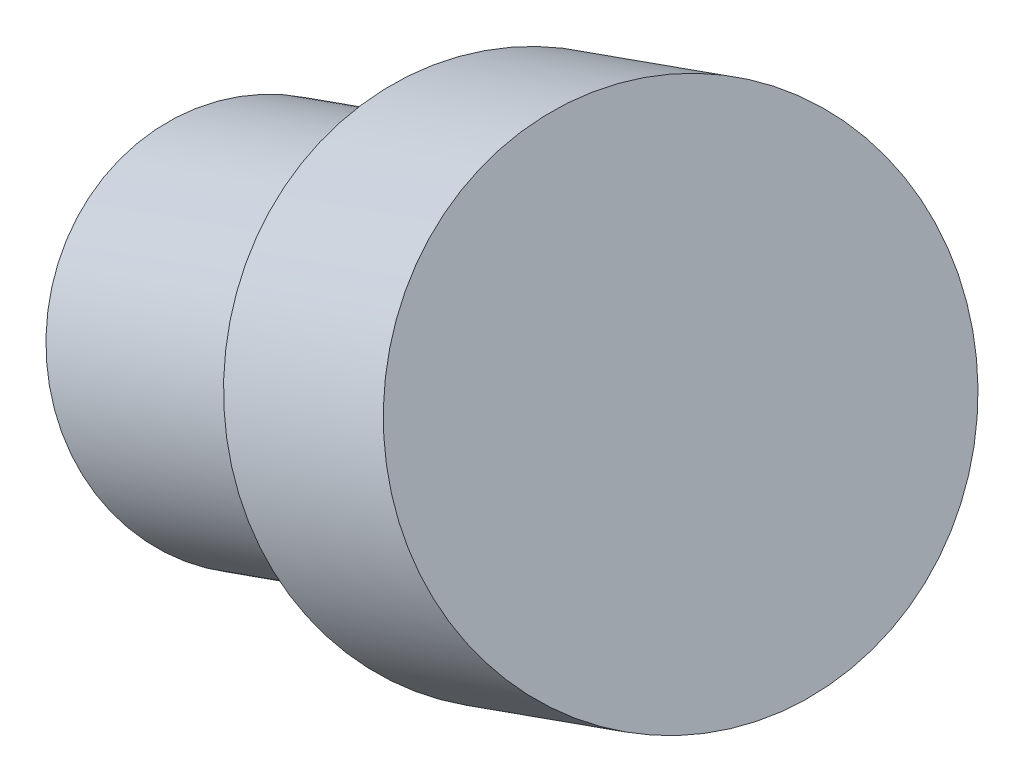
ISO-10303-21;
HEADER;
FILE_DESCRIPTION(('STEP AP214'),'2;1');
FILE_NAME('part.step','',(''),(''),'','','');
FILE_SCHEMA(('AUTOMOTIVE_DESIGN { 1 0 10303 214 1 1 1 1 }'));
ENDSEC;
DATA;
#1=APPLICATION_CONTEXT('core data for automotive mechanical design processes');
#2=APPLICATION_PROTOCOL_DEFINITION('international standard','automotive_design',2000,#1);
#3=PRODUCT_CONTEXT('',#1,'mechanical');
#4=PRODUCT('Part','Part','',(#3));
#5=PRODUCT_RELATED_PRODUCT_CATEGORY('part','',(#4));
#6=PRODUCT_DEFINITION_FORMATION('','',#4);
#7=PRODUCT_DEFINITION_CONTEXT('part definition',#1,'design');
#8=PRODUCT_DEFINITION('design','',#6,#7);
#9=PRODUCT_DEFINITION_SHAPE('','',#8);
#10=(LENGTH_UNIT() NAMED_UNIT(*) SI_UNIT(.MILLI.,.METRE.));
#11=(NAMED_UNIT(*) PLANE_ANGLE_UNIT() SI_UNIT($,.RADIAN.));
#12=(NAMED_UNIT(*) SI_UNIT($,.STERADIAN.) SOLID_ANGLE_UNIT());
#13=UNCERTAINTY_MEASURE_WITH_UNIT(LENGTH_MEASURE(1.E-05),#10,'distance_accuracy_value','');
#14=(GEOMETRIC_REPRESENTATION_CONTEXT(3) GLOBAL_UNCERTAINTY_ASSIGNED_CONTEXT((#13)) GLOBAL_UNIT_ASSIGNED_CONTEXT((#10,
#11,#12)) REPRESENTATION_CONTEXT('',''));
#15=CARTESIAN_POINT('',(0.,0.,0.));
#16=DIRECTION('',(0.,0.,1.));
#17=DIRECTION('',(1.,0.,0.));
#18=AXIS2_PLACEMENT_3D('',#15,#16,#17);
#19=CARTESIAN_POINT('',(-60.0510512479281,122.028688923609,3.4591418665578));
#20=DIRECTION('',(-0.860646213105648,-0.45399049973947,-0.230609457770521));
#21=DIRECTION('',(-0.43852114858824,0.891006524188407,-0.117501387628166));
#22=AXIS2_PLACEMENT_3D('',#19,#20,#21);
#23=CYLINDRICAL_SURFACE('',#22,32.1849383182023);
#24=CARTESIAN_POINT('',(-60.0510512479281,122.028688923609,3.4591418665578));
#25=DIRECTION('',(0.860646213105648,0.45399049973947,0.230609457770521));
#26=DIRECTION('',(0.43852114858824,-0.891006524188407,0.117501387628166));
#27=AXIS2_PLACEMENT_3D('',#24,#25,#26);
#28=CIRCLE('',#27,32.1849383182023);
#29=CARTESIAN_POINT('',(-45.9372751293884,93.3516989014891,7.2409167796735));
#30=VERTEX_POINT('',#29);
#31=EDGE_CURVE('E10',#30,#30,#28,.T.);
#32=ORIENTED_EDGE('',*,*,#31,.F.);
#33=EDGE_LOOP('',(#32));
#34=FACE_BOUND('',#33,.T.);
#35=CARTESIAN_POINT('',(-127.181455870169,86.6174299439301,-14.5283958395428));
#36=DIRECTION('',(0.860646213105648,0.45399049973947,0.230609457770521));
#37=DIRECTION('',(0.43852114858824,-0.891006524188407,0.117501387628166));
#38=AXIS2_PLACEMENT_3D('',#35,#36,#37);
#39=CIRCLE('',#38,32.1849383182023);
#40=CARTESIAN_POINT('',(-113.067679751629,57.9404399218104,-10.7466209264271));
#41=VERTEX_POINT('',#40);
#42=EDGE_CURVE('E35',#41,#41,#39,.T.);
#43=ORIENTED_EDGE('',*,*,#42,.T.);
#44=EDGE_LOOP('',(#43));
#45=FACE_BOUND('',#44,.T.);
#46=ADVANCED_FACE('F32',(#34,#45),#23,.T.);
#47=CARTESIAN_POINT('',(-127.181455870169,86.6174299439301,-14.5283958395428));
#48=DIRECTION('',(0.860646213105648,0.45399049973947,0.230609457770521));
#49=DIRECTION('',(0.43852114858824,-0.891006524188407,0.117501387628166));
#50=AXIS2_PLACEMENT_3D('',#47,#48,#49);
#51=PLANE('',#50);
#52=ORIENTED_EDGE('',*,*,#42,.F.);
#53=EDGE_LOOP('',(#52));
#54=FACE_BOUND('',#53,.T.);
#55=ADVANCED_FACE('F55',(#54),#51,.F.);
#56=CARTESIAN_POINT('',(-18.7400330188571,143.820232911103,14.5283958395428));
#57=DIRECTION('',(-0.860646213105648,-0.45399049973947,-0.230609457770521));
#58=DIRECTION('',(-0.43852114858824,0.891006524188407,-0.117501387628166));
#59=AXIS2_PLACEMENT_3D('',#56,#57,#58);
#60=CYLINDRICAL_SURFACE('',#59,44.4527610749906);
#61=CARTESIAN_POINT('',(-18.7400330188571,143.820232911103,14.5283958395428));
#62=DIRECTION('',(0.860646213105648,0.45399049973947,0.230609457770521));
#63=DIRECTION('',(0.43852114858824,-0.891006524188407,0.117501387628166));
#64=AXIS2_PLACEMENT_3D('',#61,#62,#63);
#65=CIRCLE('',#64,44.4527610749906);
#66=CARTESIAN_POINT('',(0.753442825666389,104.212532775098,19.7516569497575));
#67=VERTEX_POINT('',#66);
#68=EDGE_CURVE('E42',#67,#67,#65,.T.);
#69=ORIENTED_EDGE('',*,*,#68,.F.);
#70=EDGE_LOOP('',(#69));
#71=FACE_BOUND('',#70,.T.);
#72=CARTESIAN_POINT('',(-60.0510512479281,122.028688923609,3.4591418665578));
#73=DIRECTION('',(0.860646213105648,0.45399049973947,0.230609457770521));
#74=DIRECTION('',(0.43852114858824,-0.891006524188407,0.117501387628166));
#75=AXIS2_PLACEMENT_3D('',#72,#73,#74);
#76=CIRCLE('',#75,44.4527610749906);
#77=CARTESIAN_POINT('',(-40.5575754034047,82.4209887876037,8.68240297677252));
#78=VERTEX_POINT('',#77);
#79=EDGE_CURVE('E44',#78,#78,#76,.T.);
#80=ORIENTED_EDGE('',*,*,#79,.T.);
#81=EDGE_LOOP('',(#80));
#82=FACE_BOUND('',#81,.T.);
#83=ADVANCED_FACE('F52',(#71,#82),#60,.T.);
#84=CARTESIAN_POINT('',(-18.7400330188571,143.820232911103,14.5283958395428));
#85=DIRECTION('',(0.860646213105648,0.45399049973947,0.230609457770521));
#86=DIRECTION('',(0.43852114858824,-0.891006524188407,0.117501387628166));
#87=AXIS2_PLACEMENT_3D('',#84,#85,#86);
#88=PLANE('',#87);
#89=ORIENTED_EDGE('',*,*,#68,.T.);
#90=EDGE_LOOP('',(#89));
#91=FACE_BOUND('',#90,.T.);
#92=ADVANCED_FACE('F50',(#91),#88,.T.);
#93=CARTESIAN_POINT('',(-60.0510512479281,122.028688923609,3.4591418665578));
#94=DIRECTION('',(0.860646213105648,0.45399049973947,0.230609457770521));
#95=DIRECTION('',(0.43852114858824,-0.891006524188407,0.117501387628166));
#96=AXIS2_PLACEMENT_3D('',#93,#94,#95);
#97=PLANE('',#96);
#98=ORIENTED_EDGE('',*,*,#31,.T.);
#99=EDGE_LOOP('',(#98));
#100=FACE_BOUND('',#99,.T.);
#101=ORIENTED_EDGE('',*,*,#79,.F.);
#102=EDGE_LOOP('',(#101));
#103=FACE_BOUND('',#102,.T.);
#104=ADVANCED_FACE('F59',(#100,#103),#97,.F.);
#105=CLOSED_SHELL('',(#46,#55,#83,#92,#104));
#106=MANIFOLD_SOLID_BREP('B2',#105);
#107=ADVANCED_BREP_SHAPE_REPRESENTATION('',(#18,#106),#14);
#108=SHAPE_DEFINITION_REPRESENTATION(#9,#107);
ENDSEC;
END-ISO-10303-21;
